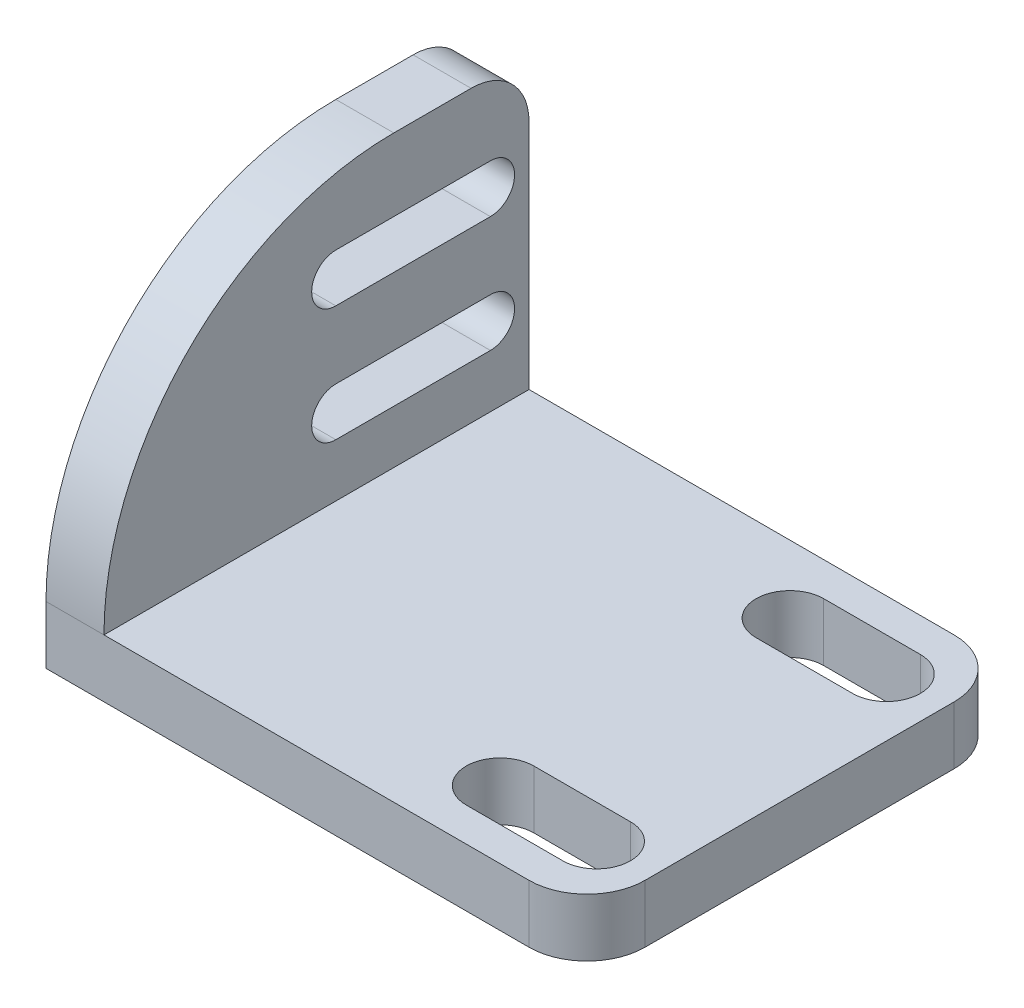
ISO-10303-21;
HEADER;
FILE_DESCRIPTION(('STEP AP214'),'2;1');
FILE_NAME('part.step','',(''),(''),'','','');
FILE_SCHEMA(('AUTOMOTIVE_DESIGN { 1 0 10303 214 1 1 1 1 }'));
ENDSEC;
DATA;
#1=APPLICATION_CONTEXT('core data for automotive mechanical design processes');
#2=APPLICATION_PROTOCOL_DEFINITION('international standard','automotive_design',2000,#1);
#3=PRODUCT_CONTEXT('',#1,'mechanical');
#4=PRODUCT('Part','Part','',(#3));
#5=PRODUCT_RELATED_PRODUCT_CATEGORY('part','',(#4));
#6=PRODUCT_DEFINITION_FORMATION('','',#4);
#7=PRODUCT_DEFINITION_CONTEXT('part definition',#1,'design');
#8=PRODUCT_DEFINITION('design','',#6,#7);
#9=PRODUCT_DEFINITION_SHAPE('','',#8);
#10=(LENGTH_UNIT() NAMED_UNIT(*) SI_UNIT(.MILLI.,.METRE.));
#11=(NAMED_UNIT(*) PLANE_ANGLE_UNIT() SI_UNIT($,.RADIAN.));
#12=(NAMED_UNIT(*) SI_UNIT($,.STERADIAN.) SOLID_ANGLE_UNIT());
#13=UNCERTAINTY_MEASURE_WITH_UNIT(LENGTH_MEASURE(1.E-05),#10,'distance_accuracy_value','');
#14=(GEOMETRIC_REPRESENTATION_CONTEXT(3) GLOBAL_UNCERTAINTY_ASSIGNED_CONTEXT((#13)) GLOBAL_UNIT_ASSIGNED_CONTEXT((#10,
#11,#12)) REPRESENTATION_CONTEXT('',''));
#15=CARTESIAN_POINT('',(0.,0.,0.));
#16=DIRECTION('',(0.,0.,1.));
#17=DIRECTION('',(1.,0.,0.));
#18=AXIS2_PLACEMENT_3D('',#15,#16,#17);
#19=CARTESIAN_POINT('',(0.,0.,22.));
#20=DIRECTION('',(0.,-1.,0.));
#21=DIRECTION('',(0.,0.,-1.));
#22=AXIS2_PLACEMENT_3D('',#19,#20,#21);
#23=PLANE('',#22);
#24=DIRECTION('',(1.,0.,0.));
#25=VECTOR('',#24,1.);
#26=CARTESIAN_POINT('',(17.,0.,5.25));
#27=LINE('',#26,#25);
#28=CARTESIAN_POINT('',(17.,0.,5.25));
#29=VERTEX_POINT('',#28);
#30=CARTESIAN_POINT('',(22.,0.,5.25));
#31=VERTEX_POINT('',#30);
#32=EDGE_CURVE('E337',#29,#31,#27,.T.);
#33=ORIENTED_EDGE('',*,*,#32,.F.);
#34=CARTESIAN_POINT('',(17.,0.,3.5));
#35=DIRECTION('',(0.,1.,0.));
#36=DIRECTION('',(0.,0.,1.));
#37=AXIS2_PLACEMENT_3D('',#34,#35,#36);
#38=CIRCLE('',#37,1.75);
#39=CARTESIAN_POINT('',(17.,0.,1.75));
#40=VERTEX_POINT('',#39);
#41=EDGE_CURVE('E334',#40,#29,#38,.T.);
#42=ORIENTED_EDGE('',*,*,#41,.F.);
#43=DIRECTION('',(-1.,0.,0.));
#44=VECTOR('',#43,1.);
#45=CARTESIAN_POINT('',(17.,0.,1.75));
#46=LINE('',#45,#44);
#47=CARTESIAN_POINT('',(22.,0.,1.75));
#48=VERTEX_POINT('',#47);
#49=EDGE_CURVE('E321',#48,#40,#46,.T.);
#50=ORIENTED_EDGE('',*,*,#49,.F.);
#51=CARTESIAN_POINT('',(22.,0.,3.5));
#52=DIRECTION('',(0.,1.,0.));
#53=DIRECTION('',(0.,0.,1.));
#54=AXIS2_PLACEMENT_3D('',#51,#52,#53);
#55=CIRCLE('',#54,1.75);
#56=EDGE_CURVE('E342',#31,#48,#55,.T.);
#57=ORIENTED_EDGE('',*,*,#56,.F.);
#58=EDGE_LOOP('',(#33,#42,#50,#57));
#59=FACE_BOUND('',#58,.T.);
#60=DIRECTION('',(1.,0.,0.));
#61=VECTOR('',#60,1.);
#62=CARTESIAN_POINT('',(17.,0.,20.25));
#63=LINE('',#62,#61);
#64=CARTESIAN_POINT('',(17.,0.,20.25));
#65=VERTEX_POINT('',#64);
#66=CARTESIAN_POINT('',(22.,0.,20.25));
#67=VERTEX_POINT('',#66);
#68=EDGE_CURVE('E384',#65,#67,#63,.T.);
#69=ORIENTED_EDGE('',*,*,#68,.F.);
#70=CARTESIAN_POINT('',(17.,0.,18.5));
#71=DIRECTION('',(0.,1.,0.));
#72=DIRECTION('',(0.,0.,1.));
#73=AXIS2_PLACEMENT_3D('',#70,#71,#72);
#74=CIRCLE('',#73,1.75);
#75=CARTESIAN_POINT('',(17.,0.,16.75));
#76=VERTEX_POINT('',#75);
#77=EDGE_CURVE('E338',#76,#65,#74,.T.);
#78=ORIENTED_EDGE('',*,*,#77,.F.);
#79=DIRECTION('',(-1.,0.,0.));
#80=VECTOR('',#79,1.);
#81=CARTESIAN_POINT('',(17.,0.,16.75));
#82=LINE('',#81,#80);
#83=CARTESIAN_POINT('',(22.,0.,16.75));
#84=VERTEX_POINT('',#83);
#85=EDGE_CURVE('E375',#84,#76,#82,.T.);
#86=ORIENTED_EDGE('',*,*,#85,.F.);
#87=CARTESIAN_POINT('',(22.,0.,18.5));
#88=DIRECTION('',(0.,1.,0.));
#89=DIRECTION('',(0.,0.,1.));
#90=AXIS2_PLACEMENT_3D('',#87,#88,#89);
#91=CIRCLE('',#90,1.75);
#92=EDGE_CURVE('E379',#67,#84,#91,.T.);
#93=ORIENTED_EDGE('',*,*,#92,.F.);
#94=EDGE_LOOP('',(#69,#78,#86,#93));
#95=FACE_BOUND('',#94,.T.);
#96=DIRECTION('',(-1.,0.,0.));
#97=VECTOR('',#96,1.);
#98=CARTESIAN_POINT('',(0.,0.,22.));
#99=LINE('',#98,#97);
#100=CARTESIAN_POINT('',(22.,0.,22.));
#101=VERTEX_POINT('',#100);
#102=CARTESIAN_POINT('',(0.,0.,22.));
#103=VERTEX_POINT('',#102);
#104=EDGE_CURVE('E404',#101,#103,#99,.T.);
#105=ORIENTED_EDGE('',*,*,#104,.F.);
#106=CARTESIAN_POINT('',(22.,0.,19.));
#107=DIRECTION('',(0.,-1.,0.));
#108=DIRECTION('',(0.,0.,-1.));
#109=AXIS2_PLACEMENT_3D('',#106,#107,#108);
#110=CIRCLE('',#109,3.);
#111=CARTESIAN_POINT('',(25.,0.,19.));
#112=VERTEX_POINT('',#111);
#113=EDGE_CURVE('E470',#101,#112,#110,.F.);
#114=ORIENTED_EDGE('',*,*,#113,.T.);
#115=DIRECTION('',(0.,0.,-1.));
#116=VECTOR('',#115,1.);
#117=CARTESIAN_POINT('',(25.,0.,22.));
#118=LINE('',#117,#116);
#119=CARTESIAN_POINT('',(25.,0.,3.));
#120=VERTEX_POINT('',#119);
#121=EDGE_CURVE('E415',#112,#120,#118,.T.);
#122=ORIENTED_EDGE('',*,*,#121,.T.);
#123=CARTESIAN_POINT('',(22.,0.,3.));
#124=DIRECTION('',(0.,-1.,0.));
#125=DIRECTION('',(0.,0.,-1.));
#126=AXIS2_PLACEMENT_3D('',#123,#124,#125);
#127=CIRCLE('',#126,3.);
#128=CARTESIAN_POINT('',(22.,0.,0.));
#129=VERTEX_POINT('',#128);
#130=EDGE_CURVE('E467',#120,#129,#127,.F.);
#131=ORIENTED_EDGE('',*,*,#130,.T.);
#132=DIRECTION('',(-1.,0.,0.));
#133=VECTOR('',#132,1.);
#134=CARTESIAN_POINT('',(0.,0.,0.));
#135=LINE('',#134,#133);
#136=CARTESIAN_POINT('',(0.,0.,0.));
#137=VERTEX_POINT('',#136);
#138=EDGE_CURVE('E352',#129,#137,#135,.T.);
#139=ORIENTED_EDGE('',*,*,#138,.T.);
#140=DIRECTION('',(0.,0.,-1.));
#141=VECTOR('',#140,1.);
#142=CARTESIAN_POINT('',(0.,0.,22.));
#143=LINE('',#142,#141);
#144=EDGE_CURVE('E445',#103,#137,#143,.T.);
#145=ORIENTED_EDGE('',*,*,#144,.F.);
#146=EDGE_LOOP('',(#105,#114,#122,#131,#139,#145));
#147=FACE_BOUND('',#146,.T.);
#148=ADVANCED_FACE('F45',(#59,#95,#147),#23,.F.);
#149=CARTESIAN_POINT('',(0.,0.,22.));
#150=DIRECTION('',(-1.,0.,0.));
#151=DIRECTION('',(0.,0.,1.));
#152=AXIS2_PLACEMENT_3D('',#149,#150,#151);
#153=PLANE('',#152);
#154=DIRECTION('',(0.,0.,-1.));
#155=VECTOR('',#154,1.);
#156=CARTESIAN_POINT('',(0.,8.75,10.));
#157=LINE('',#156,#155);
#158=CARTESIAN_POINT('',(0.,8.75,10.));
#159=VERTEX_POINT('',#158);
#160=CARTESIAN_POINT('',(0.,8.75,2.));
#161=VERTEX_POINT('',#160);
#162=EDGE_CURVE('E257',#159,#161,#157,.T.);
#163=ORIENTED_EDGE('',*,*,#162,.F.);
#164=CARTESIAN_POINT('',(0.,10.,10.));
#165=DIRECTION('',(1.,0.,0.));
#166=DIRECTION('',(0.,0.,-1.));
#167=AXIS2_PLACEMENT_3D('',#164,#165,#166);
#168=CIRCLE('',#167,1.25);
#169=CARTESIAN_POINT('',(0.,11.25,10.));
#170=VERTEX_POINT('',#169);
#171=EDGE_CURVE('E223',#170,#159,#168,.T.);
#172=ORIENTED_EDGE('',*,*,#171,.F.);
#173=DIRECTION('',(0.,0.,1.));
#174=VECTOR('',#173,1.);
#175=CARTESIAN_POINT('',(0.,11.25,10.));
#176=LINE('',#175,#174);
#177=CARTESIAN_POINT('',(0.,11.25,2.));
#178=VERTEX_POINT('',#177);
#179=EDGE_CURVE('E244',#178,#170,#176,.T.);
#180=ORIENTED_EDGE('',*,*,#179,.F.);
#181=CARTESIAN_POINT('',(0.,10.,2.));
#182=DIRECTION('',(1.,0.,0.));
#183=DIRECTION('',(0.,0.,-1.));
#184=AXIS2_PLACEMENT_3D('',#181,#182,#183);
#185=CIRCLE('',#184,1.25);
#186=EDGE_CURVE('E248',#161,#178,#185,.T.);
#187=ORIENTED_EDGE('',*,*,#186,.F.);
#188=EDGE_LOOP('',(#163,#172,#180,#187));
#189=FACE_BOUND('',#188,.T.);
#190=DIRECTION('',(0.,0.,-1.));
#191=VECTOR('',#190,1.);
#192=CARTESIAN_POINT('',(0.,2.75,10.));
#193=LINE('',#192,#191);
#194=CARTESIAN_POINT('',(0.,2.75,10.));
#195=VERTEX_POINT('',#194);
#196=CARTESIAN_POINT('',(0.,2.75,2.));
#197=VERTEX_POINT('',#196);
#198=EDGE_CURVE('E296',#195,#197,#193,.T.);
#199=ORIENTED_EDGE('',*,*,#198,.F.);
#200=CARTESIAN_POINT('',(0.,4.,10.));
#201=DIRECTION('',(1.,0.,0.));
#202=DIRECTION('',(0.,0.,-1.));
#203=AXIS2_PLACEMENT_3D('',#200,#201,#202);
#204=CIRCLE('',#203,1.25);
#205=CARTESIAN_POINT('',(0.,5.25,10.));
#206=VERTEX_POINT('',#205);
#207=EDGE_CURVE('E258',#206,#195,#204,.T.);
#208=ORIENTED_EDGE('',*,*,#207,.F.);
#209=DIRECTION('',(0.,0.,1.));
#210=VECTOR('',#209,1.);
#211=CARTESIAN_POINT('',(0.,5.25,10.));
#212=LINE('',#211,#210);
#213=CARTESIAN_POINT('',(0.,5.25,2.));
#214=VERTEX_POINT('',#213);
#215=EDGE_CURVE('E287',#214,#206,#212,.T.);
#216=ORIENTED_EDGE('',*,*,#215,.F.);
#217=CARTESIAN_POINT('',(0.,4.,2.));
#218=DIRECTION('',(1.,0.,0.));
#219=DIRECTION('',(0.,0.,-1.));
#220=AXIS2_PLACEMENT_3D('',#217,#218,#219);
#221=CIRCLE('',#220,1.25);
#222=EDGE_CURVE('E291',#197,#214,#221,.T.);
#223=ORIENTED_EDGE('',*,*,#222,.F.);
#224=EDGE_LOOP('',(#199,#208,#216,#223));
#225=FACE_BOUND('',#224,.T.);
#226=DIRECTION('',(0.,1.,0.));
#227=VECTOR('',#226,1.);
#228=CARTESIAN_POINT('',(0.,0.,0.));
#229=LINE('',#228,#227);
#230=CARTESIAN_POINT('',(0.,12.,0.));
#231=VERTEX_POINT('',#230);
#232=EDGE_CURVE('E418',#137,#231,#229,.T.);
#233=ORIENTED_EDGE('',*,*,#232,.T.);
#234=CARTESIAN_POINT('',(0.,12.,3.));
#235=DIRECTION('',(-1.,0.,0.));
#236=DIRECTION('',(0.,0.,1.));
#237=AXIS2_PLACEMENT_3D('',#234,#235,#236);
#238=CIRCLE('',#237,3.);
#239=CARTESIAN_POINT('',(0.,15.,3.));
#240=VERTEX_POINT('',#239);
#241=EDGE_CURVE('E11',#231,#240,#238,.F.);
#242=ORIENTED_EDGE('',*,*,#241,.T.);
#243=DIRECTION('',(0.,0.,-1.));
#244=VECTOR('',#243,1.);
#245=CARTESIAN_POINT('',(0.,15.,22.));
#246=LINE('',#245,#244);
#247=CARTESIAN_POINT('',(0.,15.,7.));
#248=VERTEX_POINT('',#247);
#249=EDGE_CURVE('E442',#248,#240,#246,.T.);
#250=ORIENTED_EDGE('',*,*,#249,.F.);
#251=CARTESIAN_POINT('',(0.,0.,7.));
#252=DIRECTION('',(-1.,0.,0.));
#253=DIRECTION('',(0.,0.,1.));
#254=AXIS2_PLACEMENT_3D('',#251,#252,#253);
#255=CIRCLE('',#254,15.);
#256=EDGE_CURVE('E459',#248,#103,#255,.F.);
#257=ORIENTED_EDGE('',*,*,#256,.T.);
#258=ORIENTED_EDGE('',*,*,#144,.T.);
#259=EDGE_LOOP('',(#233,#242,#250,#257,#258));
#260=FACE_BOUND('',#259,.T.);
#261=ADVANCED_FACE('F508',(#189,#225,#260),#153,.F.);
#262=CARTESIAN_POINT('',(0.,15.,22.));
#263=DIRECTION('',(0.,-1.,0.));
#264=DIRECTION('',(0.,0.,-1.));
#265=AXIS2_PLACEMENT_3D('',#262,#263,#264);
#266=PLANE('',#265);
#267=ORIENTED_EDGE('',*,*,#249,.T.);
#268=DIRECTION('',(-1.,0.,0.));
#269=VECTOR('',#268,1.);
#270=CARTESIAN_POINT('',(-3.,15.,3.));
#271=LINE('',#270,#269);
#272=CARTESIAN_POINT('',(-3.,15.,3.));
#273=VERTEX_POINT('',#272);
#274=EDGE_CURVE('E492',#240,#273,#271,.T.);
#275=ORIENTED_EDGE('',*,*,#274,.T.);
#276=DIRECTION('',(0.,0.,-1.));
#277=VECTOR('',#276,1.);
#278=CARTESIAN_POINT('',(-3.,15.,22.));
#279=LINE('',#278,#277);
#280=CARTESIAN_POINT('',(-3.,15.,7.));
#281=VERTEX_POINT('',#280);
#282=EDGE_CURVE('E438',#281,#273,#279,.T.);
#283=ORIENTED_EDGE('',*,*,#282,.F.);
#284=DIRECTION('',(-1.,0.,0.));
#285=VECTOR('',#284,1.);
#286=CARTESIAN_POINT('',(0.,15.,7.));
#287=LINE('',#286,#285);
#288=EDGE_CURVE('E456',#281,#248,#287,.F.);
#289=ORIENTED_EDGE('',*,*,#288,.T.);
#290=EDGE_LOOP('',(#267,#275,#283,#289));
#291=FACE_BOUND('',#290,.T.);
#292=ADVANCED_FACE('F505',(#291),#266,.F.);
#293=CARTESIAN_POINT('',(-3.,-3.,22.));
#294=DIRECTION('',(1.,0.,0.));
#295=DIRECTION('',(0.,0.,-1.));
#296=AXIS2_PLACEMENT_3D('',#293,#294,#295);
#297=PLANE('',#296);
#298=DIRECTION('',(0.,0.,1.));
#299=VECTOR('',#298,1.);
#300=CARTESIAN_POINT('',(-3.,11.25,10.));
#301=LINE('',#300,#299);
#302=CARTESIAN_POINT('',(-3.,11.25,2.));
#303=VERTEX_POINT('',#302);
#304=CARTESIAN_POINT('',(-3.,11.25,10.));
#305=VERTEX_POINT('',#304);
#306=EDGE_CURVE('E229',#303,#305,#301,.T.);
#307=ORIENTED_EDGE('',*,*,#306,.T.);
#308=CARTESIAN_POINT('',(-3.,10.,10.));
#309=DIRECTION('',(1.,0.,0.));
#310=DIRECTION('',(0.,0.,-1.));
#311=AXIS2_PLACEMENT_3D('',#308,#309,#310);
#312=CIRCLE('',#311,1.25);
#313=CARTESIAN_POINT('',(-3.,8.75,10.));
#314=VERTEX_POINT('',#313);
#315=EDGE_CURVE('E220',#305,#314,#312,.T.);
#316=ORIENTED_EDGE('',*,*,#315,.T.);
#317=DIRECTION('',(0.,0.,-1.));
#318=VECTOR('',#317,1.);
#319=CARTESIAN_POINT('',(-3.,8.75,10.));
#320=LINE('',#319,#318);
#321=CARTESIAN_POINT('',(-3.,8.75,2.));
#322=VERTEX_POINT('',#321);
#323=EDGE_CURVE('E233',#314,#322,#320,.T.);
#324=ORIENTED_EDGE('',*,*,#323,.T.);
#325=CARTESIAN_POINT('',(-3.,10.,2.));
#326=DIRECTION('',(1.,0.,0.));
#327=DIRECTION('',(0.,0.,-1.));
#328=AXIS2_PLACEMENT_3D('',#325,#326,#327);
#329=CIRCLE('',#328,1.25);
#330=EDGE_CURVE('E238',#322,#303,#329,.T.);
#331=ORIENTED_EDGE('',*,*,#330,.T.);
#332=EDGE_LOOP('',(#307,#316,#324,#331));
#333=FACE_BOUND('',#332,.T.);
#334=DIRECTION('',(0.,0.,1.));
#335=VECTOR('',#334,1.);
#336=CARTESIAN_POINT('',(-3.,5.25,10.));
#337=LINE('',#336,#335);
#338=CARTESIAN_POINT('',(-3.,5.25,2.));
#339=VERTEX_POINT('',#338);
#340=CARTESIAN_POINT('',(-3.,5.25,10.));
#341=VERTEX_POINT('',#340);
#342=EDGE_CURVE('E277',#339,#341,#337,.T.);
#343=ORIENTED_EDGE('',*,*,#342,.T.);
#344=CARTESIAN_POINT('',(-3.,4.,10.));
#345=DIRECTION('',(1.,0.,0.));
#346=DIRECTION('',(0.,0.,-1.));
#347=AXIS2_PLACEMENT_3D('',#344,#345,#346);
#348=CIRCLE('',#347,1.25);
#349=CARTESIAN_POINT('',(-3.,2.75,10.));
#350=VERTEX_POINT('',#349);
#351=EDGE_CURVE('E292',#341,#350,#348,.T.);
#352=ORIENTED_EDGE('',*,*,#351,.T.);
#353=DIRECTION('',(0.,0.,-1.));
#354=VECTOR('',#353,1.);
#355=CARTESIAN_POINT('',(-3.,2.75,10.));
#356=LINE('',#355,#354);
#357=CARTESIAN_POINT('',(-3.,2.75,2.));
#358=VERTEX_POINT('',#357);
#359=EDGE_CURVE('E309',#350,#358,#356,.T.);
#360=ORIENTED_EDGE('',*,*,#359,.T.);
#361=CARTESIAN_POINT('',(-3.,4.,2.));
#362=DIRECTION('',(1.,0.,0.));
#363=DIRECTION('',(0.,0.,-1.));
#364=AXIS2_PLACEMENT_3D('',#361,#362,#363);
#365=CIRCLE('',#364,1.25);
#366=EDGE_CURVE('E305',#358,#339,#365,.T.);
#367=ORIENTED_EDGE('',*,*,#366,.T.);
#368=EDGE_LOOP('',(#343,#352,#360,#367));
#369=FACE_BOUND('',#368,.T.);
#370=ORIENTED_EDGE('',*,*,#282,.T.);
#371=CARTESIAN_POINT('',(-3.,12.,3.));
#372=DIRECTION('',(1.,0.,0.));
#373=DIRECTION('',(0.,0.,-1.));
#374=AXIS2_PLACEMENT_3D('',#371,#372,#373);
#375=CIRCLE('',#374,3.);
#376=CARTESIAN_POINT('',(-3.,12.,0.));
#377=VERTEX_POINT('',#376);
#378=EDGE_CURVE('E54',#273,#377,#375,.F.);
#379=ORIENTED_EDGE('',*,*,#378,.T.);
#380=DIRECTION('',(0.,-1.,0.));
#381=VECTOR('',#380,1.);
#382=CARTESIAN_POINT('',(-3.,-3.,0.));
#383=LINE('',#382,#381);
#384=CARTESIAN_POINT('',(-3.,-3.,0.));
#385=VERTEX_POINT('',#384);
#386=EDGE_CURVE('E421',#377,#385,#383,.T.);
#387=ORIENTED_EDGE('',*,*,#386,.T.);
#388=DIRECTION('',(0.,0.,-1.));
#389=VECTOR('',#388,1.);
#390=CARTESIAN_POINT('',(-3.,-3.,22.));
#391=LINE('',#390,#389);
#392=CARTESIAN_POINT('',(-3.,-3.,22.));
#393=VERTEX_POINT('',#392);
#394=EDGE_CURVE('E434',#393,#385,#391,.T.);
#395=ORIENTED_EDGE('',*,*,#394,.F.);
#396=DIRECTION('',(0.,-1.,0.));
#397=VECTOR('',#396,1.);
#398=CARTESIAN_POINT('',(-3.,-3.,22.));
#399=LINE('',#398,#397);
#400=CARTESIAN_POINT('',(-3.,0.,22.));
#401=VERTEX_POINT('',#400);
#402=EDGE_CURVE('E407',#401,#393,#399,.T.);
#403=ORIENTED_EDGE('',*,*,#402,.F.);
#404=CARTESIAN_POINT('',(-3.,0.,7.));
#405=DIRECTION('',(1.,0.,0.));
#406=DIRECTION('',(0.,0.,-1.));
#407=AXIS2_PLACEMENT_3D('',#404,#405,#406);
#408=CIRCLE('',#407,15.);
#409=EDGE_CURVE('E453',#401,#281,#408,.F.);
#410=ORIENTED_EDGE('',*,*,#409,.T.);
#411=EDGE_LOOP('',(#370,#379,#387,#395,#403,#410));
#412=FACE_BOUND('',#411,.T.);
#413=ADVANCED_FACE('F240',(#333,#369,#412),#297,.F.);
#414=CARTESIAN_POINT('',(-3.,-3.,22.));
#415=DIRECTION('',(0.,1.,0.));
#416=DIRECTION('',(0.,0.,1.));
#417=AXIS2_PLACEMENT_3D('',#414,#415,#416);
#418=PLANE('',#417);
#419=DIRECTION('',(-1.,0.,0.));
#420=VECTOR('',#419,1.);
#421=CARTESIAN_POINT('',(17.,-3.,1.75));
#422=LINE('',#421,#420);
#423=CARTESIAN_POINT('',(22.,-3.,1.75));
#424=VERTEX_POINT('',#423);
#425=CARTESIAN_POINT('',(17.,-3.,1.75));
#426=VERTEX_POINT('',#425);
#427=EDGE_CURVE('E329',#424,#426,#422,.T.);
#428=ORIENTED_EDGE('',*,*,#427,.T.);
#429=CARTESIAN_POINT('',(17.,-3.,3.5));
#430=DIRECTION('',(0.,1.,0.));
#431=DIRECTION('',(0.,0.,1.));
#432=AXIS2_PLACEMENT_3D('',#429,#430,#431);
#433=CIRCLE('',#432,1.75);
#434=CARTESIAN_POINT('',(17.,-3.,5.25));
#435=VERTEX_POINT('',#434);
#436=EDGE_CURVE('E316',#426,#435,#433,.T.);
#437=ORIENTED_EDGE('',*,*,#436,.T.);
#438=DIRECTION('',(1.,0.,0.));
#439=VECTOR('',#438,1.);
#440=CARTESIAN_POINT('',(17.,-3.,5.25));
#441=LINE('',#440,#439);
#442=CARTESIAN_POINT('',(22.,-3.,5.25));
#443=VERTEX_POINT('',#442);
#444=EDGE_CURVE('E320',#435,#443,#441,.T.);
#445=ORIENTED_EDGE('',*,*,#444,.T.);
#446=CARTESIAN_POINT('',(22.,-3.,3.5));
#447=DIRECTION('',(0.,1.,0.));
#448=DIRECTION('',(0.,0.,1.));
#449=AXIS2_PLACEMENT_3D('',#446,#447,#448);
#450=CIRCLE('',#449,1.75);
#451=EDGE_CURVE('E325',#443,#424,#450,.T.);
#452=ORIENTED_EDGE('',*,*,#451,.T.);
#453=EDGE_LOOP('',(#428,#437,#445,#452));
#454=FACE_BOUND('',#453,.T.);
#455=DIRECTION('',(-1.,0.,0.));
#456=VECTOR('',#455,1.);
#457=CARTESIAN_POINT('',(17.,-3.,16.75));
#458=LINE('',#457,#456);
#459=CARTESIAN_POINT('',(22.,-3.,16.75));
#460=VERTEX_POINT('',#459);
#461=CARTESIAN_POINT('',(17.,-3.,16.75));
#462=VERTEX_POINT('',#461);
#463=EDGE_CURVE('E366',#460,#462,#458,.T.);
#464=ORIENTED_EDGE('',*,*,#463,.T.);
#465=CARTESIAN_POINT('',(17.,-3.,18.5));
#466=DIRECTION('',(0.,1.,0.));
#467=DIRECTION('',(0.,0.,1.));
#468=AXIS2_PLACEMENT_3D('',#465,#466,#467);
#469=CIRCLE('',#468,1.75);
#470=CARTESIAN_POINT('',(17.,-3.,20.25));
#471=VERTEX_POINT('',#470);
#472=EDGE_CURVE('E380',#462,#471,#469,.T.);
#473=ORIENTED_EDGE('',*,*,#472,.T.);
#474=DIRECTION('',(1.,0.,0.));
#475=VECTOR('',#474,1.);
#476=CARTESIAN_POINT('',(17.,-3.,20.25));
#477=LINE('',#476,#475);
#478=CARTESIAN_POINT('',(22.,-3.,20.25));
#479=VERTEX_POINT('',#478);
#480=EDGE_CURVE('E397',#471,#479,#477,.T.);
#481=ORIENTED_EDGE('',*,*,#480,.T.);
#482=CARTESIAN_POINT('',(22.,-3.,18.5));
#483=DIRECTION('',(0.,1.,0.));
#484=DIRECTION('',(0.,0.,1.));
#485=AXIS2_PLACEMENT_3D('',#482,#483,#484);
#486=CIRCLE('',#485,1.75);
#487=EDGE_CURVE('E393',#479,#460,#486,.T.);
#488=ORIENTED_EDGE('',*,*,#487,.T.);
#489=EDGE_LOOP('',(#464,#473,#481,#488));
#490=FACE_BOUND('',#489,.T.);
#491=DIRECTION('',(0.,0.,-1.));
#492=VECTOR('',#491,1.);
#493=CARTESIAN_POINT('',(25.,-3.,22.));
#494=LINE('',#493,#492);
#495=CARTESIAN_POINT('',(25.,-3.,19.));
#496=VERTEX_POINT('',#495);
#497=CARTESIAN_POINT('',(25.,-3.,3.));
#498=VERTEX_POINT('',#497);
#499=EDGE_CURVE('E430',#496,#498,#494,.T.);
#500=ORIENTED_EDGE('',*,*,#499,.F.);
#501=CARTESIAN_POINT('',(22.,-3.,19.));
#502=DIRECTION('',(0.,1.,0.));
#503=DIRECTION('',(0.,0.,1.));
#504=AXIS2_PLACEMENT_3D('',#501,#502,#503);
#505=CIRCLE('',#504,3.);
#506=CARTESIAN_POINT('',(22.,-3.,22.));
#507=VERTEX_POINT('',#506);
#508=EDGE_CURVE('E483',#496,#507,#505,.F.);
#509=ORIENTED_EDGE('',*,*,#508,.T.);
#510=DIRECTION('',(1.,0.,0.));
#511=VECTOR('',#510,1.);
#512=CARTESIAN_POINT('',(-3.,-3.,22.));
#513=LINE('',#512,#511);
#514=EDGE_CURVE('E411',#393,#507,#513,.T.);
#515=ORIENTED_EDGE('',*,*,#514,.F.);
#516=ORIENTED_EDGE('',*,*,#394,.T.);
#517=DIRECTION('',(1.,0.,0.));
#518=VECTOR('',#517,1.);
#519=CARTESIAN_POINT('',(-3.,-3.,0.));
#520=LINE('',#519,#518);
#521=CARTESIAN_POINT('',(22.,-3.,0.));
#522=VERTEX_POINT('',#521);
#523=EDGE_CURVE('E408',#385,#522,#520,.T.);
#524=ORIENTED_EDGE('',*,*,#523,.T.);
#525=CARTESIAN_POINT('',(22.,-3.,3.));
#526=DIRECTION('',(0.,1.,0.));
#527=DIRECTION('',(0.,0.,1.));
#528=AXIS2_PLACEMENT_3D('',#525,#526,#527);
#529=CIRCLE('',#528,3.);
#530=EDGE_CURVE('E480',#522,#498,#529,.F.);
#531=ORIENTED_EDGE('',*,*,#530,.T.);
#532=EDGE_LOOP('',(#500,#509,#515,#516,#524,#531));
#533=FACE_BOUND('',#532,.T.);
#534=ADVANCED_FACE('F520',(#454,#490,#533),#418,.F.);
#535=CARTESIAN_POINT('',(25.,0.,22.));
#536=DIRECTION('',(-1.,0.,0.));
#537=DIRECTION('',(0.,-1.,0.));
#538=AXIS2_PLACEMENT_3D('',#535,#536,#537);
#539=PLANE('',#538);
#540=ORIENTED_EDGE('',*,*,#121,.F.);
#541=DIRECTION('',(0.,1.,0.));
#542=VECTOR('',#541,1.);
#543=CARTESIAN_POINT('',(25.,0.,19.));
#544=LINE('',#543,#542);
#545=EDGE_CURVE('E477',#112,#496,#544,.F.);
#546=ORIENTED_EDGE('',*,*,#545,.T.);
#547=ORIENTED_EDGE('',*,*,#499,.T.);
#548=DIRECTION('',(0.,1.,0.));
#549=VECTOR('',#548,1.);
#550=CARTESIAN_POINT('',(25.,0.,3.));
#551=LINE('',#550,#549);
#552=EDGE_CURVE('E473',#498,#120,#551,.T.);
#553=ORIENTED_EDGE('',*,*,#552,.T.);
#554=EDGE_LOOP('',(#540,#546,#547,#553));
#555=FACE_BOUND('',#554,.T.);
#556=ADVANCED_FACE('F529',(#555),#539,.F.);
#557=CARTESIAN_POINT('',(0.,0.,22.));
#558=DIRECTION('',(0.,0.,-1.));
#559=DIRECTION('',(-1.,0.,0.));
#560=AXIS2_PLACEMENT_3D('',#557,#558,#559);
#561=PLANE('',#560);
#562=ORIENTED_EDGE('',*,*,#514,.T.);
#563=DIRECTION('',(0.,1.,0.));
#564=VECTOR('',#563,1.);
#565=CARTESIAN_POINT('',(22.,0.,22.));
#566=LINE('',#565,#564);
#567=EDGE_CURVE('E463',#507,#101,#566,.T.);
#568=ORIENTED_EDGE('',*,*,#567,.T.);
#569=ORIENTED_EDGE('',*,*,#104,.T.);
#570=DIRECTION('',(-1.,0.,0.));
#571=VECTOR('',#570,1.);
#572=CARTESIAN_POINT('',(0.,0.,22.));
#573=LINE('',#572,#571);
#574=EDGE_CURVE('E449',#103,#401,#573,.T.);
#575=ORIENTED_EDGE('',*,*,#574,.T.);
#576=ORIENTED_EDGE('',*,*,#402,.T.);
#577=EDGE_LOOP('',(#562,#568,#569,#575,#576));
#578=FACE_BOUND('',#577,.T.);
#579=ADVANCED_FACE('F515',(#578),#561,.F.);
#580=CARTESIAN_POINT('',(0.,0.,0.));
#581=DIRECTION('',(0.,0.,-1.));
#582=DIRECTION('',(-1.,0.,0.));
#583=AXIS2_PLACEMENT_3D('',#580,#581,#582);
#584=PLANE('',#583);
#585=ORIENTED_EDGE('',*,*,#138,.F.);
#586=DIRECTION('',(0.,1.,0.));
#587=VECTOR('',#586,1.);
#588=CARTESIAN_POINT('',(22.,-3.,0.));
#589=LINE('',#588,#587);
#590=EDGE_CURVE('E489',#129,#522,#589,.F.);
#591=ORIENTED_EDGE('',*,*,#590,.T.);
#592=ORIENTED_EDGE('',*,*,#523,.F.);
#593=ORIENTED_EDGE('',*,*,#386,.F.);
#594=DIRECTION('',(-1.,0.,0.));
#595=VECTOR('',#594,1.);
#596=CARTESIAN_POINT('',(0.,12.,0.));
#597=LINE('',#596,#595);
#598=EDGE_CURVE('E486',#377,#231,#597,.F.);
#599=ORIENTED_EDGE('',*,*,#598,.T.);
#600=ORIENTED_EDGE('',*,*,#232,.F.);
#601=EDGE_LOOP('',(#585,#591,#592,#593,#599,#600));
#602=FACE_BOUND('',#601,.T.);
#603=ADVANCED_FACE('F502',(#602),#584,.T.);
#604=CARTESIAN_POINT('',(17.,-3.,18.5));
#605=DIRECTION('',(0.,1.,0.));
#606=DIRECTION('',(0.,0.,1.));
#607=AXIS2_PLACEMENT_3D('',#604,#605,#606);
#608=CYLINDRICAL_SURFACE('',#607,1.75);
#609=ORIENTED_EDGE('',*,*,#77,.T.);
#610=DIRECTION('',(0.,1.,0.));
#611=VECTOR('',#610,1.);
#612=CARTESIAN_POINT('',(17.,-3.,20.25));
#613=LINE('',#612,#611);
#614=EDGE_CURVE('E362',#471,#65,#613,.T.);
#615=ORIENTED_EDGE('',*,*,#614,.F.);
#616=ORIENTED_EDGE('',*,*,#472,.F.);
#617=DIRECTION('',(0.,1.,0.));
#618=VECTOR('',#617,1.);
#619=CARTESIAN_POINT('',(17.,-3.,16.75));
#620=LINE('',#619,#618);
#621=EDGE_CURVE('E267',#462,#76,#620,.T.);
#622=ORIENTED_EDGE('',*,*,#621,.T.);
#623=EDGE_LOOP('',(#609,#615,#616,#622));
#624=FACE_BOUND('',#623,.T.);
#625=ADVANCED_FACE('F602',(#624),#608,.F.);
#626=CARTESIAN_POINT('',(17.,-3.,16.75));
#627=DIRECTION('',(0.,0.,-1.));
#628=DIRECTION('',(-1.,0.,0.));
#629=AXIS2_PLACEMENT_3D('',#626,#627,#628);
#630=PLANE('',#629);
#631=ORIENTED_EDGE('',*,*,#85,.T.);
#632=ORIENTED_EDGE('',*,*,#621,.F.);
#633=ORIENTED_EDGE('',*,*,#463,.F.);
#634=DIRECTION('',(0.,1.,0.));
#635=VECTOR('',#634,1.);
#636=CARTESIAN_POINT('',(22.,-3.,16.75));
#637=LINE('',#636,#635);
#638=EDGE_CURVE('E370',#460,#84,#637,.T.);
#639=ORIENTED_EDGE('',*,*,#638,.T.);
#640=EDGE_LOOP('',(#631,#632,#633,#639));
#641=FACE_BOUND('',#640,.T.);
#642=ADVANCED_FACE('F605',(#641),#630,.F.);
#643=CARTESIAN_POINT('',(22.,-3.,18.5));
#644=DIRECTION('',(0.,1.,0.));
#645=DIRECTION('',(0.,0.,1.));
#646=AXIS2_PLACEMENT_3D('',#643,#644,#645);
#647=CYLINDRICAL_SURFACE('',#646,1.75);
#648=ORIENTED_EDGE('',*,*,#92,.T.);
#649=ORIENTED_EDGE('',*,*,#638,.F.);
#650=ORIENTED_EDGE('',*,*,#487,.F.);
#651=DIRECTION('',(0.,1.,0.));
#652=VECTOR('',#651,1.);
#653=CARTESIAN_POINT('',(22.,-3.,20.25));
#654=LINE('',#653,#652);
#655=EDGE_CURVE('E367',#479,#67,#654,.T.);
#656=ORIENTED_EDGE('',*,*,#655,.T.);
#657=EDGE_LOOP('',(#648,#649,#650,#656));
#658=FACE_BOUND('',#657,.T.);
#659=ADVANCED_FACE('F609',(#658),#647,.F.);
#660=CARTESIAN_POINT('',(17.,-3.,20.25));
#661=DIRECTION('',(0.,0.,1.));
#662=DIRECTION('',(1.,0.,0.));
#663=AXIS2_PLACEMENT_3D('',#660,#661,#662);
#664=PLANE('',#663);
#665=ORIENTED_EDGE('',*,*,#68,.T.);
#666=ORIENTED_EDGE('',*,*,#655,.F.);
#667=ORIENTED_EDGE('',*,*,#480,.F.);
#668=ORIENTED_EDGE('',*,*,#614,.T.);
#669=EDGE_LOOP('',(#665,#666,#667,#668));
#670=FACE_BOUND('',#669,.T.);
#671=ADVANCED_FACE('F600',(#670),#664,.F.);
#672=CARTESIAN_POINT('',(17.,-3.,3.5));
#673=DIRECTION('',(0.,1.,0.));
#674=DIRECTION('',(0.,0.,1.));
#675=AXIS2_PLACEMENT_3D('',#672,#673,#674);
#676=CYLINDRICAL_SURFACE('',#675,1.75);
#677=ORIENTED_EDGE('',*,*,#41,.T.);
#678=DIRECTION('',(0.,1.,0.));
#679=VECTOR('',#678,1.);
#680=CARTESIAN_POINT('',(17.,-3.,5.25));
#681=LINE('',#680,#679);
#682=EDGE_CURVE('E333',#435,#29,#681,.T.);
#683=ORIENTED_EDGE('',*,*,#682,.F.);
#684=ORIENTED_EDGE('',*,*,#436,.F.);
#685=DIRECTION('',(0.,1.,0.));
#686=VECTOR('',#685,1.);
#687=CARTESIAN_POINT('',(17.,-3.,1.75));
#688=LINE('',#687,#686);
#689=EDGE_CURVE('E349',#426,#40,#688,.T.);
#690=ORIENTED_EDGE('',*,*,#689,.T.);
#691=EDGE_LOOP('',(#677,#683,#684,#690));
#692=FACE_BOUND('',#691,.T.);
#693=ADVANCED_FACE('F590',(#692),#676,.F.);
#694=CARTESIAN_POINT('',(17.,-3.,1.75));
#695=DIRECTION('',(0.,0.,-1.));
#696=DIRECTION('',(-1.,0.,0.));
#697=AXIS2_PLACEMENT_3D('',#694,#695,#696);
#698=PLANE('',#697);
#699=ORIENTED_EDGE('',*,*,#49,.T.);
#700=ORIENTED_EDGE('',*,*,#689,.F.);
#701=ORIENTED_EDGE('',*,*,#427,.F.);
#702=DIRECTION('',(0.,1.,0.));
#703=VECTOR('',#702,1.);
#704=CARTESIAN_POINT('',(22.,-3.,1.75));
#705=LINE('',#704,#703);
#706=EDGE_CURVE('E353',#424,#48,#705,.T.);
#707=ORIENTED_EDGE('',*,*,#706,.T.);
#708=EDGE_LOOP('',(#699,#700,#701,#707));
#709=FACE_BOUND('',#708,.T.);
#710=ADVANCED_FACE('F586',(#709),#698,.F.);
#711=CARTESIAN_POINT('',(22.,-3.,3.5));
#712=DIRECTION('',(0.,1.,0.));
#713=DIRECTION('',(0.,0.,1.));
#714=AXIS2_PLACEMENT_3D('',#711,#712,#713);
#715=CYLINDRICAL_SURFACE('',#714,1.75);
#716=ORIENTED_EDGE('',*,*,#56,.T.);
#717=ORIENTED_EDGE('',*,*,#706,.F.);
#718=ORIENTED_EDGE('',*,*,#451,.F.);
#719=DIRECTION('',(0.,1.,0.));
#720=VECTOR('',#719,1.);
#721=CARTESIAN_POINT('',(22.,-3.,5.25));
#722=LINE('',#721,#720);
#723=EDGE_CURVE('E356',#443,#31,#722,.T.);
#724=ORIENTED_EDGE('',*,*,#723,.T.);
#725=EDGE_LOOP('',(#716,#717,#718,#724));
#726=FACE_BOUND('',#725,.T.);
#727=ADVANCED_FACE('F589',(#726),#715,.F.);
#728=CARTESIAN_POINT('',(17.,-3.,5.25));
#729=DIRECTION('',(0.,0.,1.));
#730=DIRECTION('',(1.,0.,0.));
#731=AXIS2_PLACEMENT_3D('',#728,#729,#730);
#732=PLANE('',#731);
#733=ORIENTED_EDGE('',*,*,#32,.T.);
#734=ORIENTED_EDGE('',*,*,#723,.F.);
#735=ORIENTED_EDGE('',*,*,#444,.F.);
#736=ORIENTED_EDGE('',*,*,#682,.T.);
#737=EDGE_LOOP('',(#733,#734,#735,#736));
#738=FACE_BOUND('',#737,.T.);
#739=ADVANCED_FACE('F574',(#738),#732,.F.);
#740=CARTESIAN_POINT('',(-3.,4.,10.));
#741=DIRECTION('',(1.,0.,0.));
#742=DIRECTION('',(0.,0.,-1.));
#743=AXIS2_PLACEMENT_3D('',#740,#741,#742);
#744=CYLINDRICAL_SURFACE('',#743,1.25);
#745=ORIENTED_EDGE('',*,*,#207,.T.);
#746=DIRECTION('',(1.,0.,0.));
#747=VECTOR('',#746,1.);
#748=CARTESIAN_POINT('',(-3.,2.75,10.));
#749=LINE('',#748,#747);
#750=EDGE_CURVE('E273',#350,#195,#749,.T.);
#751=ORIENTED_EDGE('',*,*,#750,.F.);
#752=ORIENTED_EDGE('',*,*,#351,.F.);
#753=DIRECTION('',(1.,0.,0.));
#754=VECTOR('',#753,1.);
#755=CARTESIAN_POINT('',(-3.,5.25,10.));
#756=LINE('',#755,#754);
#757=EDGE_CURVE('E284',#341,#206,#756,.T.);
#758=ORIENTED_EDGE('',*,*,#757,.T.);
#759=EDGE_LOOP('',(#745,#751,#752,#758));
#760=FACE_BOUND('',#759,.T.);
#761=ADVANCED_FACE('F570',(#760),#744,.F.);
#762=CARTESIAN_POINT('',(-3.,5.25,10.));
#763=DIRECTION('',(0.,1.,0.));
#764=DIRECTION('',(0.,0.,1.));
#765=AXIS2_PLACEMENT_3D('',#762,#763,#764);
#766=PLANE('',#765);
#767=ORIENTED_EDGE('',*,*,#215,.T.);
#768=ORIENTED_EDGE('',*,*,#757,.F.);
#769=ORIENTED_EDGE('',*,*,#342,.F.);
#770=DIRECTION('',(1.,0.,0.));
#771=VECTOR('',#770,1.);
#772=CARTESIAN_POINT('',(-3.,5.25,2.));
#773=LINE('',#772,#771);
#774=EDGE_CURVE('E281',#339,#214,#773,.T.);
#775=ORIENTED_EDGE('',*,*,#774,.T.);
#776=EDGE_LOOP('',(#767,#768,#769,#775));
#777=FACE_BOUND('',#776,.T.);
#778=ADVANCED_FACE('F573',(#777),#766,.F.);
#779=CARTESIAN_POINT('',(-3.,4.,2.));
#780=DIRECTION('',(1.,0.,0.));
#781=DIRECTION('',(0.,0.,-1.));
#782=AXIS2_PLACEMENT_3D('',#779,#780,#781);
#783=CYLINDRICAL_SURFACE('',#782,1.25);
#784=ORIENTED_EDGE('',*,*,#222,.T.);
#785=ORIENTED_EDGE('',*,*,#774,.F.);
#786=ORIENTED_EDGE('',*,*,#366,.F.);
#787=DIRECTION('',(1.,0.,0.));
#788=VECTOR('',#787,1.);
#789=CARTESIAN_POINT('',(-3.,2.75,2.));
#790=LINE('',#789,#788);
#791=EDGE_CURVE('E278',#358,#197,#790,.T.);
#792=ORIENTED_EDGE('',*,*,#791,.T.);
#793=EDGE_LOOP('',(#784,#785,#786,#792));
#794=FACE_BOUND('',#793,.T.);
#795=ADVANCED_FACE('F578',(#794),#783,.F.);
#796=CARTESIAN_POINT('',(-3.,2.75,10.));
#797=DIRECTION('',(0.,-1.,0.));
#798=DIRECTION('',(0.,0.,-1.));
#799=AXIS2_PLACEMENT_3D('',#796,#797,#798);
#800=PLANE('',#799);
#801=ORIENTED_EDGE('',*,*,#198,.T.);
#802=ORIENTED_EDGE('',*,*,#791,.F.);
#803=ORIENTED_EDGE('',*,*,#359,.F.);
#804=ORIENTED_EDGE('',*,*,#750,.T.);
#805=EDGE_LOOP('',(#801,#802,#803,#804));
#806=FACE_BOUND('',#805,.T.);
#807=ADVANCED_FACE('F569',(#806),#800,.F.);
#808=CARTESIAN_POINT('',(-3.,10.,10.));
#809=DIRECTION('',(1.,0.,0.));
#810=DIRECTION('',(0.,0.,-1.));
#811=AXIS2_PLACEMENT_3D('',#808,#809,#810);
#812=CYLINDRICAL_SURFACE('',#811,1.25);
#813=ORIENTED_EDGE('',*,*,#171,.T.);
#814=DIRECTION('',(1.,0.,0.));
#815=VECTOR('',#814,1.);
#816=CARTESIAN_POINT('',(-3.,8.75,10.));
#817=LINE('',#816,#815);
#818=EDGE_CURVE('E216',#314,#159,#817,.T.);
#819=ORIENTED_EDGE('',*,*,#818,.F.);
#820=ORIENTED_EDGE('',*,*,#315,.F.);
#821=DIRECTION('',(1.,0.,0.));
#822=VECTOR('',#821,1.);
#823=CARTESIAN_POINT('',(-3.,11.25,10.));
#824=LINE('',#823,#822);
#825=EDGE_CURVE('E264',#305,#170,#824,.T.);
#826=ORIENTED_EDGE('',*,*,#825,.T.);
#827=EDGE_LOOP('',(#813,#819,#820,#826));
#828=FACE_BOUND('',#827,.T.);
#829=ADVANCED_FACE('F218',(#828),#812,.F.);
#830=CARTESIAN_POINT('',(-3.,11.25,10.));
#831=DIRECTION('',(0.,1.,0.));
#832=DIRECTION('',(0.,0.,1.));
#833=AXIS2_PLACEMENT_3D('',#830,#831,#832);
#834=PLANE('',#833);
#835=ORIENTED_EDGE('',*,*,#179,.T.);
#836=ORIENTED_EDGE('',*,*,#825,.F.);
#837=ORIENTED_EDGE('',*,*,#306,.F.);
#838=DIRECTION('',(1.,0.,0.));
#839=VECTOR('',#838,1.);
#840=CARTESIAN_POINT('',(-3.,11.25,2.));
#841=LINE('',#840,#839);
#842=EDGE_CURVE('E268',#303,#178,#841,.T.);
#843=ORIENTED_EDGE('',*,*,#842,.T.);
#844=EDGE_LOOP('',(#835,#836,#837,#843));
#845=FACE_BOUND('',#844,.T.);
#846=ADVANCED_FACE('F562',(#845),#834,.F.);
#847=CARTESIAN_POINT('',(-3.,10.,2.));
#848=DIRECTION('',(1.,0.,0.));
#849=DIRECTION('',(0.,0.,-1.));
#850=AXIS2_PLACEMENT_3D('',#847,#848,#849);
#851=CYLINDRICAL_SURFACE('',#850,1.25);
#852=ORIENTED_EDGE('',*,*,#186,.T.);
#853=ORIENTED_EDGE('',*,*,#842,.F.);
#854=ORIENTED_EDGE('',*,*,#330,.F.);
#855=DIRECTION('',(1.,0.,0.));
#856=VECTOR('',#855,1.);
#857=CARTESIAN_POINT('',(-3.,8.75,2.));
#858=LINE('',#857,#856);
#859=EDGE_CURVE('E228',#322,#161,#858,.T.);
#860=ORIENTED_EDGE('',*,*,#859,.T.);
#861=EDGE_LOOP('',(#852,#853,#854,#860));
#862=FACE_BOUND('',#861,.T.);
#863=ADVANCED_FACE('F557',(#862),#851,.F.);
#864=CARTESIAN_POINT('',(-3.,8.75,10.));
#865=DIRECTION('',(0.,-1.,0.));
#866=DIRECTION('',(0.,0.,-1.));
#867=AXIS2_PLACEMENT_3D('',#864,#865,#866);
#868=PLANE('',#867);
#869=ORIENTED_EDGE('',*,*,#162,.T.);
#870=ORIENTED_EDGE('',*,*,#859,.F.);
#871=ORIENTED_EDGE('',*,*,#323,.F.);
#872=ORIENTED_EDGE('',*,*,#818,.T.);
#873=EDGE_LOOP('',(#869,#870,#871,#872));
#874=FACE_BOUND('',#873,.T.);
#875=ADVANCED_FACE('F234',(#874),#868,.F.);
#876=CARTESIAN_POINT('',(0.,0.,7.));
#877=DIRECTION('',(-1.,0.,0.));
#878=DIRECTION('',(0.,0.,1.));
#879=AXIS2_PLACEMENT_3D('',#876,#877,#878);
#880=CYLINDRICAL_SURFACE('',#879,15.);
#881=ORIENTED_EDGE('',*,*,#256,.F.);
#882=ORIENTED_EDGE('',*,*,#288,.F.);
#883=ORIENTED_EDGE('',*,*,#409,.F.);
#884=ORIENTED_EDGE('',*,*,#574,.F.);
#885=EDGE_LOOP('',(#881,#882,#883,#884));
#886=FACE_BOUND('',#885,.T.);
#887=ADVANCED_FACE('F512',(#886),#880,.T.);
#888=CARTESIAN_POINT('',(22.,0.,19.));
#889=DIRECTION('',(0.,1.,0.));
#890=DIRECTION('',(-1.,0.,0.));
#891=AXIS2_PLACEMENT_3D('',#888,#889,#890);
#892=CYLINDRICAL_SURFACE('',#891,3.);
#893=ORIENTED_EDGE('',*,*,#508,.F.);
#894=ORIENTED_EDGE('',*,*,#545,.F.);
#895=ORIENTED_EDGE('',*,*,#113,.F.);
#896=ORIENTED_EDGE('',*,*,#567,.F.);
#897=EDGE_LOOP('',(#893,#894,#895,#896));
#898=FACE_BOUND('',#897,.T.);
#899=ADVANCED_FACE('F524',(#898),#892,.T.);
#900=CARTESIAN_POINT('',(22.,0.,3.));
#901=DIRECTION('',(0.,-1.,0.));
#902=DIRECTION('',(1.,0.,0.));
#903=AXIS2_PLACEMENT_3D('',#900,#901,#902);
#904=CYLINDRICAL_SURFACE('',#903,3.);
#905=ORIENTED_EDGE('',*,*,#530,.F.);
#906=ORIENTED_EDGE('',*,*,#590,.F.);
#907=ORIENTED_EDGE('',*,*,#130,.F.);
#908=ORIENTED_EDGE('',*,*,#552,.F.);
#909=EDGE_LOOP('',(#905,#906,#907,#908));
#910=FACE_BOUND('',#909,.T.);
#911=ADVANCED_FACE('F533',(#910),#904,.T.);
#912=CARTESIAN_POINT('',(0.,12.,3.));
#913=DIRECTION('',(1.,0.,0.));
#914=DIRECTION('',(0.,0.,-1.));
#915=AXIS2_PLACEMENT_3D('',#912,#913,#914);
#916=CYLINDRICAL_SURFACE('',#915,3.);
#917=ORIENTED_EDGE('',*,*,#241,.F.);
#918=ORIENTED_EDGE('',*,*,#598,.F.);
#919=ORIENTED_EDGE('',*,*,#378,.F.);
#920=ORIENTED_EDGE('',*,*,#274,.F.);
#921=EDGE_LOOP('',(#917,#918,#919,#920));
#922=FACE_BOUND('',#921,.T.);
#923=ADVANCED_FACE('F47',(#922),#916,.T.);
#924=CLOSED_SHELL('',(#148,#261,#292,#413,#534,#556,#579,#603,#625,#642,#659,#671,#693,#710,
#727,#739,#761,#778,#795,#807,#829,#846,#863,#875,#887,#899,#911,#923));
#925=MANIFOLD_SOLID_BREP('B2',#924);
#926=ADVANCED_BREP_SHAPE_REPRESENTATION('',(#18,#925),#14);
#927=SHAPE_DEFINITION_REPRESENTATION(#9,#926);
ENDSEC;
END-ISO-10303-21;
